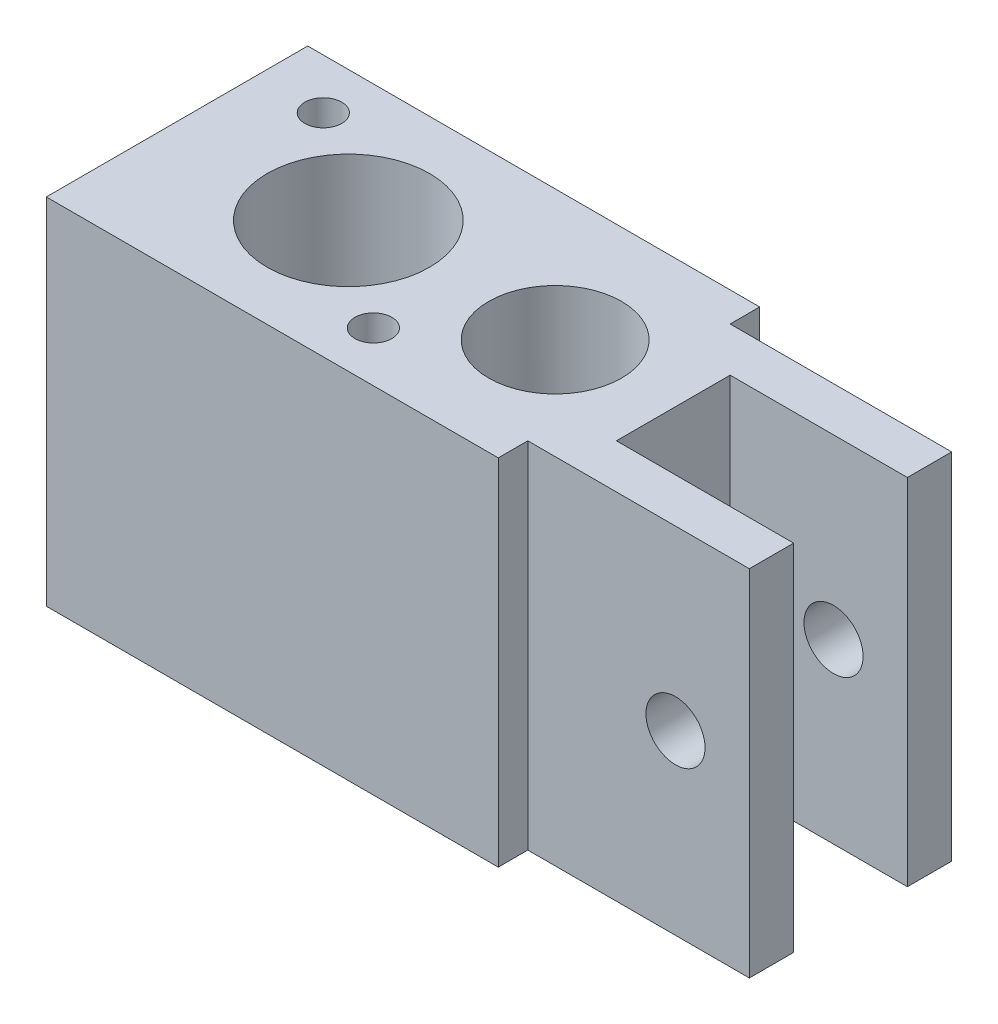
ISO-10303-21;
HEADER;
FILE_DESCRIPTION(('STEP AP214'),'2;1');
FILE_NAME('part.step','',(''),(''),'','','');
FILE_SCHEMA(('AUTOMOTIVE_DESIGN { 1 0 10303 214 1 1 1 1 }'));
ENDSEC;
DATA;
#1=APPLICATION_CONTEXT('core data for automotive mechanical design processes');
#2=APPLICATION_PROTOCOL_DEFINITION('international standard','automotive_design',2000,#1);
#3=PRODUCT_CONTEXT('',#1,'mechanical');
#4=PRODUCT('Part','Part','',(#3));
#5=PRODUCT_RELATED_PRODUCT_CATEGORY('part','',(#4));
#6=PRODUCT_DEFINITION_FORMATION('','',#4);
#7=PRODUCT_DEFINITION_CONTEXT('part definition',#1,'design');
#8=PRODUCT_DEFINITION('design','',#6,#7);
#9=PRODUCT_DEFINITION_SHAPE('','',#8);
#10=(LENGTH_UNIT() NAMED_UNIT(*) SI_UNIT(.MILLI.,.METRE.));
#11=(NAMED_UNIT(*) PLANE_ANGLE_UNIT() SI_UNIT($,.RADIAN.));
#12=(NAMED_UNIT(*) SI_UNIT($,.STERADIAN.) SOLID_ANGLE_UNIT());
#13=UNCERTAINTY_MEASURE_WITH_UNIT(LENGTH_MEASURE(1.E-05),#10,'distance_accuracy_value','');
#14=(GEOMETRIC_REPRESENTATION_CONTEXT(3) GLOBAL_UNCERTAINTY_ASSIGNED_CONTEXT((#13)) GLOBAL_UNIT_ASSIGNED_CONTEXT((#10,
#11,#12)) REPRESENTATION_CONTEXT('',''));
#15=CARTESIAN_POINT('',(0.,0.,0.));
#16=DIRECTION('',(0.,0.,1.));
#17=DIRECTION('',(1.,0.,0.));
#18=AXIS2_PLACEMENT_3D('',#15,#16,#17);
#19=CARTESIAN_POINT('',(0.,578.1,0.));
#20=DIRECTION('',(0.,-1.,0.));
#21=DIRECTION('',(0.,0.,-1.));
#22=AXIS2_PLACEMENT_3D('',#19,#20,#21);
#23=PLANE('',#22);
#24=CARTESIAN_POINT('',(7.15534400125918,578.1,5.45903400096063));
#25=DIRECTION('',(0.,1.,0.));
#26=DIRECTION('',(0.,0.,1.));
#27=AXIS2_PLACEMENT_3D('',#24,#25,#26);
#28=CIRCLE('',#27,1.25);
#29=CARTESIAN_POINT('',(7.15534400125918,578.1,6.70903400096063));
#30=VERTEX_POINT('',#29);
#31=EDGE_CURVE('E310',#30,#30,#28,.T.);
#32=ORIENTED_EDGE('',*,*,#31,.F.);
#33=EDGE_LOOP('',(#32));
#34=FACE_BOUND('',#33,.T.);
#35=CARTESIAN_POINT('',(-7.15534400125918,578.1,-5.45903400096064));
#36=DIRECTION('',(0.,1.,0.));
#37=DIRECTION('',(0.,0.,1.));
#38=AXIS2_PLACEMENT_3D('',#35,#36,#37);
#39=CIRCLE('',#38,1.25);
#40=CARTESIAN_POINT('',(-7.15534400125918,578.1,-4.20903400096064));
#41=VERTEX_POINT('',#40);
#42=EDGE_CURVE('E307',#41,#41,#39,.T.);
#43=ORIENTED_EDGE('',*,*,#42,.F.);
#44=EDGE_LOOP('',(#43));
#45=FACE_BOUND('',#44,.T.);
#46=CARTESIAN_POINT('',(14.,578.1,0.));
#47=DIRECTION('',(0.,1.,0.));
#48=DIRECTION('',(0.,0.,1.));
#49=AXIS2_PLACEMENT_3D('',#46,#47,#48);
#50=CIRCLE('',#49,4.5);
#51=CARTESIAN_POINT('',(14.,578.1,4.5));
#52=VERTEX_POINT('',#51);
#53=EDGE_CURVE('E154',#52,#52,#50,.T.);
#54=ORIENTED_EDGE('',*,*,#53,.F.);
#55=EDGE_LOOP('',(#54));
#56=FACE_BOUND('',#55,.T.);
#57=CARTESIAN_POINT('',(0.,578.1,0.));
#58=DIRECTION('',(0.,1.,0.));
#59=DIRECTION('',(0.,0.,1.));
#60=AXIS2_PLACEMENT_3D('',#57,#58,#59);
#61=CIRCLE('',#60,5.5);
#62=CARTESIAN_POINT('',(0.,578.1,5.5));
#63=VERTEX_POINT('',#62);
#64=EDGE_CURVE('E149',#63,#63,#61,.T.);
#65=ORIENTED_EDGE('',*,*,#64,.F.);
#66=EDGE_LOOP('',(#65));
#67=FACE_BOUND('',#66,.T.);
#68=DIRECTION('',(0.,0.,1.));
#69=VECTOR('',#68,1.);
#70=CARTESIAN_POINT('',(-11.6000000000001,578.1,-8.84999999999999));
#71=LINE('',#70,#69);
#72=CARTESIAN_POINT('',(-11.6000000000001,578.1,-8.84999999999999));
#73=VERTEX_POINT('',#72);
#74=CARTESIAN_POINT('',(-11.6000000000001,578.1,8.84999999999999));
#75=VERTEX_POINT('',#74);
#76=EDGE_CURVE('E132',#73,#75,#71,.T.);
#77=ORIENTED_EDGE('',*,*,#76,.T.);
#78=DIRECTION('',(1.,0.,0.));
#79=VECTOR('',#78,1.);
#80=CARTESIAN_POINT('',(-12.6000000000001,578.1,8.84999999999999));
#81=LINE('',#80,#79);
#82=CARTESIAN_POINT('',(18.9999999999999,578.1,8.84999999999999));
#83=VERTEX_POINT('',#82);
#84=EDGE_CURVE('E148',#75,#83,#81,.T.);
#85=ORIENTED_EDGE('',*,*,#84,.T.);
#86=DIRECTION('',(0.,0.,-1.));
#87=VECTOR('',#86,1.);
#88=CARTESIAN_POINT('',(18.9999999999999,578.1,8.84999999999999));
#89=LINE('',#88,#87);
#90=CARTESIAN_POINT('',(18.9999999999999,578.1,6.84999999999999));
#91=VERTEX_POINT('',#90);
#92=EDGE_CURVE('E151',#83,#91,#89,.T.);
#93=ORIENTED_EDGE('',*,*,#92,.T.);
#94=DIRECTION('',(1.,0.,0.));
#95=VECTOR('',#94,1.);
#96=CARTESIAN_POINT('',(18.9999999999999,578.1,6.84999999999999));
#97=LINE('',#96,#95);
#98=CARTESIAN_POINT('',(33.9999999999999,578.1,6.85));
#99=VERTEX_POINT('',#98);
#100=EDGE_CURVE('E159',#91,#99,#97,.T.);
#101=ORIENTED_EDGE('',*,*,#100,.T.);
#102=DIRECTION('',(0.,0.,-1.));
#103=VECTOR('',#102,1.);
#104=CARTESIAN_POINT('',(33.9999999999999,578.1,6.85));
#105=LINE('',#104,#103);
#106=CARTESIAN_POINT('',(34.,578.1,3.85));
#107=VERTEX_POINT('',#106);
#108=EDGE_CURVE('E161',#99,#107,#105,.T.);
#109=ORIENTED_EDGE('',*,*,#108,.T.);
#110=DIRECTION('',(-1.,0.,0.));
#111=VECTOR('',#110,1.);
#112=CARTESIAN_POINT('',(22.,578.1,3.85));
#113=LINE('',#112,#111);
#114=CARTESIAN_POINT('',(22.,578.1,3.85));
#115=VERTEX_POINT('',#114);
#116=EDGE_CURVE('E163',#107,#115,#113,.T.);
#117=ORIENTED_EDGE('',*,*,#116,.T.);
#118=DIRECTION('',(0.,0.,-1.));
#119=VECTOR('',#118,1.);
#120=CARTESIAN_POINT('',(22.,578.1,3.85));
#121=LINE('',#120,#119);
#122=CARTESIAN_POINT('',(22.,578.1,-3.85));
#123=VERTEX_POINT('',#122);
#124=EDGE_CURVE('E165',#115,#123,#121,.T.);
#125=ORIENTED_EDGE('',*,*,#124,.T.);
#126=DIRECTION('',(1.,0.,0.));
#127=VECTOR('',#126,1.);
#128=CARTESIAN_POINT('',(22.,578.1,-3.85));
#129=LINE('',#128,#127);
#130=CARTESIAN_POINT('',(34.,578.1,-3.85));
#131=VERTEX_POINT('',#130);
#132=EDGE_CURVE('E167',#123,#131,#129,.T.);
#133=ORIENTED_EDGE('',*,*,#132,.T.);
#134=DIRECTION('',(0.,0.,-1.));
#135=VECTOR('',#134,1.);
#136=CARTESIAN_POINT('',(34.,578.1,-6.85));
#137=LINE('',#136,#135);
#138=CARTESIAN_POINT('',(34.,578.1,-6.85));
#139=VERTEX_POINT('',#138);
#140=EDGE_CURVE('E169',#131,#139,#137,.T.);
#141=ORIENTED_EDGE('',*,*,#140,.T.);
#142=DIRECTION('',(-1.,0.,0.));
#143=VECTOR('',#142,1.);
#144=CARTESIAN_POINT('',(19.,578.1,-6.84999999999999));
#145=LINE('',#144,#143);
#146=CARTESIAN_POINT('',(19.,578.1,-6.84999999999999));
#147=VERTEX_POINT('',#146);
#148=EDGE_CURVE('E171',#139,#147,#145,.T.);
#149=ORIENTED_EDGE('',*,*,#148,.T.);
#150=DIRECTION('',(0.,0.,-1.));
#151=VECTOR('',#150,1.);
#152=CARTESIAN_POINT('',(19.,578.1,-8.84999999999999));
#153=LINE('',#152,#151);
#154=CARTESIAN_POINT('',(19.,578.1,-8.84999999999999));
#155=VERTEX_POINT('',#154);
#156=EDGE_CURVE('E65',#147,#155,#153,.T.);
#157=ORIENTED_EDGE('',*,*,#156,.T.);
#158=DIRECTION('',(-1.,0.,0.));
#159=VECTOR('',#158,1.);
#160=CARTESIAN_POINT('',(-12.6,578.1,-8.84999999999999));
#161=LINE('',#160,#159);
#162=EDGE_CURVE('E145',#155,#73,#161,.T.);
#163=ORIENTED_EDGE('',*,*,#162,.T.);
#164=EDGE_LOOP('',(#77,#85,#93,#101,#109,#117,#125,#133,#141,#149,#157,#163));
#165=FACE_BOUND('',#164,.T.);
#166=ADVANCED_FACE('F40',(#34,#45,#56,#67,#165),#23,.F.);
#167=CARTESIAN_POINT('',(-12.6,578.1,-8.84999999999999));
#168=DIRECTION('',(0.,0.,1.));
#169=DIRECTION('',(1.,0.,0.));
#170=AXIS2_PLACEMENT_3D('',#167,#168,#169);
#171=PLANE('',#170);
#172=DIRECTION('',(0.,-1.,0.));
#173=VECTOR('',#172,1.);
#174=CARTESIAN_POINT('',(-11.6000000000001,578.1,-8.84999999999999));
#175=LINE('',#174,#173);
#176=CARTESIAN_POINT('',(-11.6000000000001,554.1,-8.84999999999999));
#177=VERTEX_POINT('',#176);
#178=EDGE_CURVE('E135',#73,#177,#175,.T.);
#179=ORIENTED_EDGE('',*,*,#178,.F.);
#180=ORIENTED_EDGE('',*,*,#162,.F.);
#181=DIRECTION('',(0.,-1.,0.));
#182=VECTOR('',#181,1.);
#183=CARTESIAN_POINT('',(19.,578.1,-8.84999999999999));
#184=LINE('',#183,#182);
#185=CARTESIAN_POINT('',(19.,554.1,-8.84999999999999));
#186=VERTEX_POINT('',#185);
#187=EDGE_CURVE('E174',#155,#186,#184,.T.);
#188=ORIENTED_EDGE('',*,*,#187,.T.);
#189=DIRECTION('',(1.,0.,0.));
#190=VECTOR('',#189,1.);
#191=CARTESIAN_POINT('',(-11.6000000000001,554.1,-8.84999999999999));
#192=LINE('',#191,#190);
#193=EDGE_CURVE('E57',#177,#186,#192,.T.);
#194=ORIENTED_EDGE('',*,*,#193,.F.);
#195=EDGE_LOOP('',(#179,#180,#188,#194));
#196=FACE_BOUND('',#195,.T.);
#197=ADVANCED_FACE('F42',(#196),#171,.F.);
#198=CARTESIAN_POINT('',(-12.6000000000001,578.1,8.84999999999999));
#199=DIRECTION('',(0.,0.,-1.));
#200=DIRECTION('',(-1.,0.,0.));
#201=AXIS2_PLACEMENT_3D('',#198,#199,#200);
#202=PLANE('',#201);
#203=DIRECTION('',(0.,-1.,0.));
#204=VECTOR('',#203,1.);
#205=CARTESIAN_POINT('',(-11.6000000000001,578.1,8.84999999999999));
#206=LINE('',#205,#204);
#207=CARTESIAN_POINT('',(-11.6000000000001,554.1,8.84999999999999));
#208=VERTEX_POINT('',#207);
#209=EDGE_CURVE('E137',#75,#208,#206,.T.);
#210=ORIENTED_EDGE('',*,*,#209,.T.);
#211=DIRECTION('',(1.,0.,0.));
#212=VECTOR('',#211,1.);
#213=CARTESIAN_POINT('',(-11.6000000000001,554.1,8.84999999999999));
#214=LINE('',#213,#212);
#215=CARTESIAN_POINT('',(18.9999999999999,554.1,8.84999999999999));
#216=VERTEX_POINT('',#215);
#217=EDGE_CURVE('E146',#208,#216,#214,.T.);
#218=ORIENTED_EDGE('',*,*,#217,.T.);
#219=DIRECTION('',(0.,-1.,0.));
#220=VECTOR('',#219,1.);
#221=CARTESIAN_POINT('',(18.9999999999999,578.1,8.84999999999999));
#222=LINE('',#221,#220);
#223=EDGE_CURVE('E12',#83,#216,#222,.T.);
#224=ORIENTED_EDGE('',*,*,#223,.F.);
#225=ORIENTED_EDGE('',*,*,#84,.F.);
#226=EDGE_LOOP('',(#210,#218,#224,#225));
#227=FACE_BOUND('',#226,.T.);
#228=ADVANCED_FACE('F260',(#227),#202,.F.);
#229=CARTESIAN_POINT('',(18.9999999999999,578.1,8.84999999999999));
#230=DIRECTION('',(-1.,0.,0.));
#231=DIRECTION('',(0.,0.,1.));
#232=AXIS2_PLACEMENT_3D('',#229,#230,#231);
#233=PLANE('',#232);
#234=DIRECTION('',(0.,0.,1.));
#235=VECTOR('',#234,1.);
#236=CARTESIAN_POINT('',(18.9999999999999,554.1,8.84999999999999));
#237=LINE('',#236,#235);
#238=CARTESIAN_POINT('',(18.9999999999999,554.1,6.84999999999999));
#239=VERTEX_POINT('',#238);
#240=EDGE_CURVE('E222',#239,#216,#237,.T.);
#241=ORIENTED_EDGE('',*,*,#240,.F.);
#242=DIRECTION('',(0.,-1.,0.));
#243=VECTOR('',#242,1.);
#244=CARTESIAN_POINT('',(18.9999999999999,578.1,6.84999999999999));
#245=LINE('',#244,#243);
#246=EDGE_CURVE('E49',#91,#239,#245,.T.);
#247=ORIENTED_EDGE('',*,*,#246,.F.);
#248=ORIENTED_EDGE('',*,*,#92,.F.);
#249=ORIENTED_EDGE('',*,*,#223,.T.);
#250=EDGE_LOOP('',(#241,#247,#248,#249));
#251=FACE_BOUND('',#250,.T.);
#252=ADVANCED_FACE('F262',(#251),#233,.F.);
#253=CARTESIAN_POINT('',(18.9999999999999,578.1,6.84999999999999));
#254=DIRECTION('',(0.,0.,-1.));
#255=DIRECTION('',(-1.,0.,0.));
#256=AXIS2_PLACEMENT_3D('',#253,#254,#255);
#257=PLANE('',#256);
#258=CARTESIAN_POINT('',(29.,566.1,6.84999999999999));
#259=DIRECTION('',(0.,0.,-1.));
#260=DIRECTION('',(-1.,0.,0.));
#261=AXIS2_PLACEMENT_3D('',#258,#259,#260);
#262=CIRCLE('',#261,2.);
#263=CARTESIAN_POINT('',(27.,566.1,6.84999999999999));
#264=VERTEX_POINT('',#263);
#265=EDGE_CURVE('E230',#264,#264,#262,.T.);
#266=ORIENTED_EDGE('',*,*,#265,.T.);
#267=EDGE_LOOP('',(#266));
#268=FACE_BOUND('',#267,.T.);
#269=DIRECTION('',(-1.,0.,0.));
#270=VECTOR('',#269,1.);
#271=CARTESIAN_POINT('',(18.9999999999999,554.1,6.84999999999999));
#272=LINE('',#271,#270);
#273=CARTESIAN_POINT('',(34.,554.1,6.85));
#274=VERTEX_POINT('',#273);
#275=EDGE_CURVE('E220',#274,#239,#272,.T.);
#276=ORIENTED_EDGE('',*,*,#275,.F.);
#277=DIRECTION('',(0.,-1.,0.));
#278=VECTOR('',#277,1.);
#279=CARTESIAN_POINT('',(33.9999999999999,578.1,6.85));
#280=LINE('',#279,#278);
#281=EDGE_CURVE('E194',#99,#274,#280,.T.);
#282=ORIENTED_EDGE('',*,*,#281,.F.);
#283=ORIENTED_EDGE('',*,*,#100,.F.);
#284=ORIENTED_EDGE('',*,*,#246,.T.);
#285=EDGE_LOOP('',(#276,#282,#283,#284));
#286=FACE_BOUND('',#285,.T.);
#287=ADVANCED_FACE('F268',(#268,#286),#257,.F.);
#288=CARTESIAN_POINT('',(33.9999999999999,578.1,6.85));
#289=DIRECTION('',(-1.,0.,0.));
#290=DIRECTION('',(0.,0.,1.));
#291=AXIS2_PLACEMENT_3D('',#288,#289,#290);
#292=PLANE('',#291);
#293=DIRECTION('',(0.,0.,1.));
#294=VECTOR('',#293,1.);
#295=CARTESIAN_POINT('',(34.,554.1,-8.84999999999999));
#296=LINE('',#295,#294);
#297=CARTESIAN_POINT('',(34.,554.1,3.85));
#298=VERTEX_POINT('',#297);
#299=EDGE_CURVE('E139',#298,#274,#296,.T.);
#300=ORIENTED_EDGE('',*,*,#299,.F.);
#301=DIRECTION('',(0.,-1.,0.));
#302=VECTOR('',#301,1.);
#303=CARTESIAN_POINT('',(34.,578.1,3.85));
#304=LINE('',#303,#302);
#305=EDGE_CURVE('E191',#107,#298,#304,.T.);
#306=ORIENTED_EDGE('',*,*,#305,.F.);
#307=ORIENTED_EDGE('',*,*,#108,.F.);
#308=ORIENTED_EDGE('',*,*,#281,.T.);
#309=EDGE_LOOP('',(#300,#306,#307,#308));
#310=FACE_BOUND('',#309,.T.);
#311=ADVANCED_FACE('F271',(#310),#292,.F.);
#312=CARTESIAN_POINT('',(22.,578.1,3.85));
#313=DIRECTION('',(0.,0.,1.));
#314=DIRECTION('',(1.,0.,0.));
#315=AXIS2_PLACEMENT_3D('',#312,#313,#314);
#316=PLANE('',#315);
#317=CARTESIAN_POINT('',(29.,566.1,3.85));
#318=DIRECTION('',(0.,0.,1.));
#319=DIRECTION('',(1.,0.,0.));
#320=AXIS2_PLACEMENT_3D('',#317,#318,#319);
#321=CIRCLE('',#320,2.);
#322=CARTESIAN_POINT('',(31.,566.1,3.85));
#323=VERTEX_POINT('',#322);
#324=EDGE_CURVE('E227',#323,#323,#321,.T.);
#325=ORIENTED_EDGE('',*,*,#324,.T.);
#326=EDGE_LOOP('',(#325));
#327=FACE_BOUND('',#326,.T.);
#328=DIRECTION('',(1.,0.,0.));
#329=VECTOR('',#328,1.);
#330=CARTESIAN_POINT('',(22.,554.1,3.85));
#331=LINE('',#330,#329);
#332=CARTESIAN_POINT('',(22.,554.1,3.85));
#333=VERTEX_POINT('',#332);
#334=EDGE_CURVE('E218',#333,#298,#331,.T.);
#335=ORIENTED_EDGE('',*,*,#334,.F.);
#336=DIRECTION('',(0.,-1.,0.));
#337=VECTOR('',#336,1.);
#338=CARTESIAN_POINT('',(22.,578.1,3.85));
#339=LINE('',#338,#337);
#340=EDGE_CURVE('E188',#115,#333,#339,.T.);
#341=ORIENTED_EDGE('',*,*,#340,.F.);
#342=ORIENTED_EDGE('',*,*,#116,.F.);
#343=ORIENTED_EDGE('',*,*,#305,.T.);
#344=EDGE_LOOP('',(#335,#341,#342,#343));
#345=FACE_BOUND('',#344,.T.);
#346=ADVANCED_FACE('F276',(#327,#345),#316,.F.);
#347=CARTESIAN_POINT('',(22.,578.1,3.85));
#348=DIRECTION('',(-1.,0.,0.));
#349=DIRECTION('',(0.,0.,1.));
#350=AXIS2_PLACEMENT_3D('',#347,#348,#349);
#351=PLANE('',#350);
#352=DIRECTION('',(0.,0.,1.));
#353=VECTOR('',#352,1.);
#354=CARTESIAN_POINT('',(22.,554.1,3.85));
#355=LINE('',#354,#353);
#356=CARTESIAN_POINT('',(22.,554.1,-3.85));
#357=VERTEX_POINT('',#356);
#358=EDGE_CURVE('E216',#357,#333,#355,.T.);
#359=ORIENTED_EDGE('',*,*,#358,.F.);
#360=DIRECTION('',(0.,-1.,0.));
#361=VECTOR('',#360,1.);
#362=CARTESIAN_POINT('',(22.,578.1,-3.85));
#363=LINE('',#362,#361);
#364=EDGE_CURVE('E185',#123,#357,#363,.T.);
#365=ORIENTED_EDGE('',*,*,#364,.F.);
#366=ORIENTED_EDGE('',*,*,#124,.F.);
#367=ORIENTED_EDGE('',*,*,#340,.T.);
#368=EDGE_LOOP('',(#359,#365,#366,#367));
#369=FACE_BOUND('',#368,.T.);
#370=ADVANCED_FACE('F283',(#369),#351,.F.);
#371=CARTESIAN_POINT('',(22.,578.1,-3.85));
#372=DIRECTION('',(0.,0.,-1.));
#373=DIRECTION('',(-1.,0.,0.));
#374=AXIS2_PLACEMENT_3D('',#371,#372,#373);
#375=PLANE('',#374);
#376=CARTESIAN_POINT('',(29.,566.1,-3.85));
#377=DIRECTION('',(0.,0.,-1.));
#378=DIRECTION('',(-1.,0.,0.));
#379=AXIS2_PLACEMENT_3D('',#376,#377,#378);
#380=CIRCLE('',#379,2.);
#381=CARTESIAN_POINT('',(27.,566.1,-3.85));
#382=VERTEX_POINT('',#381);
#383=EDGE_CURVE('E224',#382,#382,#380,.T.);
#384=ORIENTED_EDGE('',*,*,#383,.T.);
#385=EDGE_LOOP('',(#384));
#386=FACE_BOUND('',#385,.T.);
#387=DIRECTION('',(-1.,0.,0.));
#388=VECTOR('',#387,1.);
#389=CARTESIAN_POINT('',(22.,554.1,-3.85));
#390=LINE('',#389,#388);
#391=CARTESIAN_POINT('',(34.,554.1,-3.85));
#392=VERTEX_POINT('',#391);
#393=EDGE_CURVE('E214',#392,#357,#390,.T.);
#394=ORIENTED_EDGE('',*,*,#393,.F.);
#395=DIRECTION('',(0.,-1.,0.));
#396=VECTOR('',#395,1.);
#397=CARTESIAN_POINT('',(34.,578.1,-3.85));
#398=LINE('',#397,#396);
#399=EDGE_CURVE('E182',#131,#392,#398,.T.);
#400=ORIENTED_EDGE('',*,*,#399,.F.);
#401=ORIENTED_EDGE('',*,*,#132,.F.);
#402=ORIENTED_EDGE('',*,*,#364,.T.);
#403=EDGE_LOOP('',(#394,#400,#401,#402));
#404=FACE_BOUND('',#403,.T.);
#405=ADVANCED_FACE('F286',(#386,#404),#375,.F.);
#406=CARTESIAN_POINT('',(34.,578.1,-6.85));
#407=DIRECTION('',(-1.,0.,0.));
#408=DIRECTION('',(0.,0.,1.));
#409=AXIS2_PLACEMENT_3D('',#406,#407,#408);
#410=PLANE('',#409);
#411=CARTESIAN_POINT('',(34.,554.1,-6.85));
#412=VERTEX_POINT('',#411);
#413=EDGE_CURVE('E298',#412,#392,#296,.T.);
#414=ORIENTED_EDGE('',*,*,#413,.F.);
#415=DIRECTION('',(0.,-1.,0.));
#416=VECTOR('',#415,1.);
#417=CARTESIAN_POINT('',(34.,578.1,-6.85));
#418=LINE('',#417,#416);
#419=EDGE_CURVE('E179',#139,#412,#418,.T.);
#420=ORIENTED_EDGE('',*,*,#419,.F.);
#421=ORIENTED_EDGE('',*,*,#140,.F.);
#422=ORIENTED_EDGE('',*,*,#399,.T.);
#423=EDGE_LOOP('',(#414,#420,#421,#422));
#424=FACE_BOUND('',#423,.T.);
#425=ADVANCED_FACE('F291',(#424),#410,.F.);
#426=CARTESIAN_POINT('',(19.,578.1,-6.84999999999999));
#427=DIRECTION('',(0.,0.,1.));
#428=DIRECTION('',(1.,0.,0.));
#429=AXIS2_PLACEMENT_3D('',#426,#427,#428);
#430=PLANE('',#429);
#431=CARTESIAN_POINT('',(29.,566.1,-6.85));
#432=DIRECTION('',(0.,0.,1.));
#433=DIRECTION('',(1.,0.,0.));
#434=AXIS2_PLACEMENT_3D('',#431,#432,#433);
#435=CIRCLE('',#434,2.);
#436=CARTESIAN_POINT('',(31.,566.1,-6.85));
#437=VERTEX_POINT('',#436);
#438=EDGE_CURVE('E44',#437,#437,#435,.T.);
#439=ORIENTED_EDGE('',*,*,#438,.T.);
#440=EDGE_LOOP('',(#439));
#441=FACE_BOUND('',#440,.T.);
#442=DIRECTION('',(1.,0.,0.));
#443=VECTOR('',#442,1.);
#444=CARTESIAN_POINT('',(19.,554.1,-6.84999999999999));
#445=LINE('',#444,#443);
#446=CARTESIAN_POINT('',(19.,554.1,-6.85));
#447=VERTEX_POINT('',#446);
#448=EDGE_CURVE('E212',#447,#412,#445,.T.);
#449=ORIENTED_EDGE('',*,*,#448,.F.);
#450=DIRECTION('',(0.,-1.,0.));
#451=VECTOR('',#450,1.);
#452=CARTESIAN_POINT('',(19.,578.1,-6.84999999999999));
#453=LINE('',#452,#451);
#454=EDGE_CURVE('E176',#147,#447,#453,.T.);
#455=ORIENTED_EDGE('',*,*,#454,.F.);
#456=ORIENTED_EDGE('',*,*,#148,.F.);
#457=ORIENTED_EDGE('',*,*,#419,.T.);
#458=EDGE_LOOP('',(#449,#455,#456,#457));
#459=FACE_BOUND('',#458,.T.);
#460=ADVANCED_FACE('F296',(#441,#459),#430,.F.);
#461=CARTESIAN_POINT('',(19.,578.1,-8.84999999999999));
#462=DIRECTION('',(-1.,0.,0.));
#463=DIRECTION('',(0.,0.,1.));
#464=AXIS2_PLACEMENT_3D('',#461,#462,#463);
#465=PLANE('',#464);
#466=DIRECTION('',(0.,0.,1.));
#467=VECTOR('',#466,1.);
#468=CARTESIAN_POINT('',(19.,554.1,-8.84999999999999));
#469=LINE('',#468,#467);
#470=EDGE_CURVE('E204',#186,#447,#469,.T.);
#471=ORIENTED_EDGE('',*,*,#470,.F.);
#472=ORIENTED_EDGE('',*,*,#187,.F.);
#473=ORIENTED_EDGE('',*,*,#156,.F.);
#474=ORIENTED_EDGE('',*,*,#454,.T.);
#475=EDGE_LOOP('',(#471,#472,#473,#474));
#476=FACE_BOUND('',#475,.T.);
#477=ADVANCED_FACE('F246',(#476),#465,.F.);
#478=CARTESIAN_POINT('',(0.,578.1,0.));
#479=DIRECTION('',(0.,-1.,0.));
#480=DIRECTION('',(0.,0.,-1.));
#481=AXIS2_PLACEMENT_3D('',#478,#479,#480);
#482=CYLINDRICAL_SURFACE('',#481,5.5);
#483=ORIENTED_EDGE('',*,*,#64,.T.);
#484=EDGE_LOOP('',(#483));
#485=FACE_BOUND('',#484,.T.);
#486=CARTESIAN_POINT('',(0.,554.1,0.));
#487=DIRECTION('',(0.,-1.,0.));
#488=DIRECTION('',(0.,0.,-1.));
#489=AXIS2_PLACEMENT_3D('',#486,#487,#488);
#490=CIRCLE('',#489,5.5);
#491=CARTESIAN_POINT('',(0.,554.1,-5.5));
#492=VERTEX_POINT('',#491);
#493=EDGE_CURVE('E200',#492,#492,#490,.T.);
#494=ORIENTED_EDGE('',*,*,#493,.T.);
#495=EDGE_LOOP('',(#494));
#496=FACE_BOUND('',#495,.T.);
#497=ADVANCED_FACE('F243',(#485,#496),#482,.F.);
#498=CARTESIAN_POINT('',(14.,578.1,0.));
#499=DIRECTION('',(0.,-1.,0.));
#500=DIRECTION('',(0.,0.,-1.));
#501=AXIS2_PLACEMENT_3D('',#498,#499,#500);
#502=CYLINDRICAL_SURFACE('',#501,4.5);
#503=ORIENTED_EDGE('',*,*,#53,.T.);
#504=EDGE_LOOP('',(#503));
#505=FACE_BOUND('',#504,.T.);
#506=CARTESIAN_POINT('',(14.,554.1,0.));
#507=DIRECTION('',(0.,-1.,0.));
#508=DIRECTION('',(0.,0.,-1.));
#509=AXIS2_PLACEMENT_3D('',#506,#507,#508);
#510=CIRCLE('',#509,4.5);
#511=CARTESIAN_POINT('',(14.,554.1,-4.5));
#512=VERTEX_POINT('',#511);
#513=EDGE_CURVE('E198',#512,#512,#510,.T.);
#514=ORIENTED_EDGE('',*,*,#513,.T.);
#515=EDGE_LOOP('',(#514));
#516=FACE_BOUND('',#515,.T.);
#517=ADVANCED_FACE('F235',(#505,#516),#502,.F.);
#518=CARTESIAN_POINT('',(-11.6000000000001,554.1,-8.84999999999999));
#519=DIRECTION('',(0.,-1.,0.));
#520=DIRECTION('',(0.,0.,-1.));
#521=AXIS2_PLACEMENT_3D('',#518,#519,#520);
#522=PLANE('',#521);
#523=ORIENTED_EDGE('',*,*,#513,.F.);
#524=EDGE_LOOP('',(#523));
#525=FACE_BOUND('',#524,.T.);
#526=ORIENTED_EDGE('',*,*,#493,.F.);
#527=EDGE_LOOP('',(#526));
#528=FACE_BOUND('',#527,.T.);
#529=ORIENTED_EDGE('',*,*,#240,.T.);
#530=ORIENTED_EDGE('',*,*,#217,.F.);
#531=DIRECTION('',(0.,0.,1.));
#532=VECTOR('',#531,1.);
#533=CARTESIAN_POINT('',(-11.6000000000001,554.1,-8.84999999999999));
#534=LINE('',#533,#532);
#535=EDGE_CURVE('E299',#177,#208,#534,.T.);
#536=ORIENTED_EDGE('',*,*,#535,.F.);
#537=ORIENTED_EDGE('',*,*,#193,.T.);
#538=ORIENTED_EDGE('',*,*,#470,.T.);
#539=ORIENTED_EDGE('',*,*,#448,.T.);
#540=ORIENTED_EDGE('',*,*,#413,.T.);
#541=ORIENTED_EDGE('',*,*,#393,.T.);
#542=ORIENTED_EDGE('',*,*,#358,.T.);
#543=ORIENTED_EDGE('',*,*,#334,.T.);
#544=ORIENTED_EDGE('',*,*,#299,.T.);
#545=ORIENTED_EDGE('',*,*,#275,.T.);
#546=EDGE_LOOP('',(#529,#530,#536,#537,#538,#539,#540,#541,#542,#543,#544,#545));
#547=FACE_BOUND('',#546,.T.);
#548=ADVANCED_FACE('F250',(#525,#528,#547),#522,.T.);
#549=CARTESIAN_POINT('',(-11.6000000000001,578.1,-8.84999999999999));
#550=DIRECTION('',(-1.,0.,0.));
#551=DIRECTION('',(0.,-1.,0.));
#552=AXIS2_PLACEMENT_3D('',#549,#550,#551);
#553=PLANE('',#552);
#554=ORIENTED_EDGE('',*,*,#76,.F.);
#555=ORIENTED_EDGE('',*,*,#178,.T.);
#556=ORIENTED_EDGE('',*,*,#535,.T.);
#557=ORIENTED_EDGE('',*,*,#209,.F.);
#558=EDGE_LOOP('',(#554,#555,#556,#557));
#559=FACE_BOUND('',#558,.T.);
#560=ADVANCED_FACE('F134',(#559),#553,.T.);
#561=CARTESIAN_POINT('',(29.,566.1,-8.84999999999999));
#562=DIRECTION('',(0.,0.,1.));
#563=DIRECTION('',(1.,0.,0.));
#564=AXIS2_PLACEMENT_3D('',#561,#562,#563);
#565=CYLINDRICAL_SURFACE('',#564,2.);
#566=ORIENTED_EDGE('',*,*,#438,.F.);
#567=EDGE_LOOP('',(#566));
#568=FACE_BOUND('',#567,.T.);
#569=ORIENTED_EDGE('',*,*,#383,.F.);
#570=EDGE_LOOP('',(#569));
#571=FACE_BOUND('',#570,.T.);
#572=ADVANCED_FACE('F338',(#568,#571),#565,.F.);
#573=ORIENTED_EDGE('',*,*,#324,.F.);
#574=EDGE_LOOP('',(#573));
#575=FACE_BOUND('',#574,.T.);
#576=ORIENTED_EDGE('',*,*,#265,.F.);
#577=EDGE_LOOP('',(#576));
#578=FACE_BOUND('',#577,.T.);
#579=ADVANCED_FACE('F329',(#575,#578),#565,.F.);
#580=CARTESIAN_POINT('',(-7.15534400125918,572.1,-5.45903400096064));
#581=DIRECTION('',(0.,1.,0.));
#582=DIRECTION('',(0.,0.,1.));
#583=AXIS2_PLACEMENT_3D('',#580,#581,#582);
#584=CYLINDRICAL_SURFACE('',#583,1.25);
#585=CARTESIAN_POINT('',(-7.15534400125918,572.1,-5.45903400096064));
#586=DIRECTION('',(0.,1.,0.));
#587=DIRECTION('',(0.,0.,1.));
#588=AXIS2_PLACEMENT_3D('',#585,#586,#587);
#589=CIRCLE('',#588,1.25);
#590=CARTESIAN_POINT('',(-7.15534400125918,572.1,-4.20903400096064));
#591=VERTEX_POINT('',#590);
#592=EDGE_CURVE('E304',#591,#591,#589,.T.);
#593=ORIENTED_EDGE('',*,*,#592,.F.);
#594=EDGE_LOOP('',(#593));
#595=FACE_BOUND('',#594,.T.);
#596=ORIENTED_EDGE('',*,*,#42,.T.);
#597=EDGE_LOOP('',(#596));
#598=FACE_BOUND('',#597,.T.);
#599=ADVANCED_FACE('F327',(#595,#598),#584,.F.);
#600=CARTESIAN_POINT('',(-7.15534400125918,572.1,-5.45903400096064));
#601=DIRECTION('',(0.,1.,0.));
#602=DIRECTION('',(0.,0.,1.));
#603=AXIS2_PLACEMENT_3D('',#600,#601,#602);
#604=PLANE('',#603);
#605=ORIENTED_EDGE('',*,*,#592,.T.);
#606=EDGE_LOOP('',(#605));
#607=FACE_BOUND('',#606,.T.);
#608=ADVANCED_FACE('F321',(#607),#604,.T.);
#609=CARTESIAN_POINT('',(7.15534400125918,572.1,5.45903400096063));
#610=DIRECTION('',(0.,1.,0.));
#611=DIRECTION('',(0.,0.,1.));
#612=AXIS2_PLACEMENT_3D('',#609,#610,#611);
#613=CYLINDRICAL_SURFACE('',#612,1.25);
#614=CARTESIAN_POINT('',(7.15534400125918,572.1,5.45903400096063));
#615=DIRECTION('',(0.,1.,0.));
#616=DIRECTION('',(0.,0.,1.));
#617=AXIS2_PLACEMENT_3D('',#614,#615,#616);
#618=CIRCLE('',#617,1.25);
#619=CARTESIAN_POINT('',(7.15534400125918,572.1,6.70903400096063));
#620=VERTEX_POINT('',#619);
#621=EDGE_CURVE('E140',#620,#620,#618,.T.);
#622=ORIENTED_EDGE('',*,*,#621,.F.);
#623=EDGE_LOOP('',(#622));
#624=FACE_BOUND('',#623,.T.);
#625=ORIENTED_EDGE('',*,*,#31,.T.);
#626=EDGE_LOOP('',(#625));
#627=FACE_BOUND('',#626,.T.);
#628=ADVANCED_FACE('F318',(#624,#627),#613,.F.);
#629=CARTESIAN_POINT('',(7.15534400125918,572.1,5.45903400096063));
#630=DIRECTION('',(0.,1.,0.));
#631=DIRECTION('',(0.,0.,1.));
#632=AXIS2_PLACEMENT_3D('',#629,#630,#631);
#633=PLANE('',#632);
#634=ORIENTED_EDGE('',*,*,#621,.T.);
#635=EDGE_LOOP('',(#634));
#636=FACE_BOUND('',#635,.T.);
#637=ADVANCED_FACE('F316',(#636),#633,.T.);
#638=CLOSED_SHELL('',(#166,#197,#228,#252,#287,#311,#346,#370,#405,#425,#460,#477,#497,#517,
#548,#560,#572,#579,#599,#608,#628,#637));
#639=MANIFOLD_SOLID_BREP('B2',#638);
#640=ADVANCED_BREP_SHAPE_REPRESENTATION('',(#18,#639),#14);
#641=SHAPE_DEFINITION_REPRESENTATION(#9,#640);
ENDSEC;
END-ISO-10303-21;
